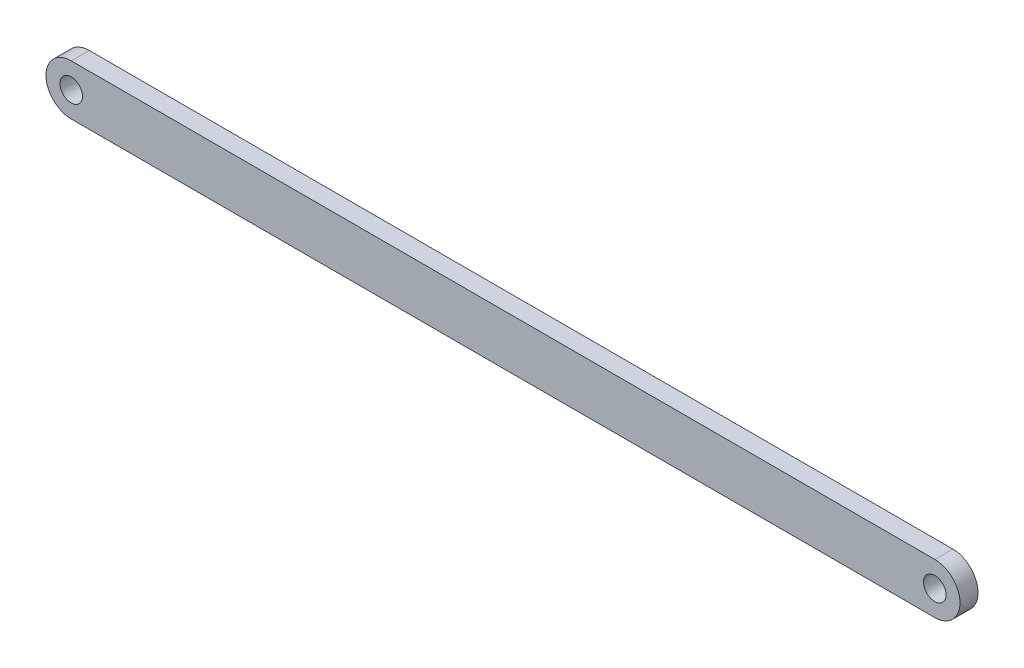
ISO-10303-21;
HEADER;
FILE_DESCRIPTION(('STEP AP214'),'2;1');
FILE_NAME('part.step','',(''),(''),'','','');
FILE_SCHEMA(('AUTOMOTIVE_DESIGN { 1 0 10303 214 1 1 1 1 }'));
ENDSEC;
DATA;
#1=APPLICATION_CONTEXT('core data for automotive mechanical design processes');
#2=APPLICATION_PROTOCOL_DEFINITION('international standard','automotive_design',2000,#1);
#3=PRODUCT_CONTEXT('',#1,'mechanical');
#4=PRODUCT('Part','Part','',(#3));
#5=PRODUCT_RELATED_PRODUCT_CATEGORY('part','',(#4));
#6=PRODUCT_DEFINITION_FORMATION('','',#4);
#7=PRODUCT_DEFINITION_CONTEXT('part definition',#1,'design');
#8=PRODUCT_DEFINITION('design','',#6,#7);
#9=PRODUCT_DEFINITION_SHAPE('','',#8);
#10=(LENGTH_UNIT() NAMED_UNIT(*) SI_UNIT(.MILLI.,.METRE.));
#11=(NAMED_UNIT(*) PLANE_ANGLE_UNIT() SI_UNIT($,.RADIAN.));
#12=(NAMED_UNIT(*) SI_UNIT($,.STERADIAN.) SOLID_ANGLE_UNIT());
#13=UNCERTAINTY_MEASURE_WITH_UNIT(LENGTH_MEASURE(1.E-05),#10,'distance_accuracy_value','');
#14=(GEOMETRIC_REPRESENTATION_CONTEXT(3) GLOBAL_UNCERTAINTY_ASSIGNED_CONTEXT((#13)) GLOBAL_UNIT_ASSIGNED_CONTEXT((#10,
#11,#12)) REPRESENTATION_CONTEXT('',''));
#15=CARTESIAN_POINT('',(0.,0.,0.));
#16=DIRECTION('',(0.,0.,1.));
#17=DIRECTION('',(1.,0.,0.));
#18=AXIS2_PLACEMENT_3D('',#15,#16,#17);
#19=CARTESIAN_POINT('',(-76.2,0.,3.175));
#20=DIRECTION('',(0.,0.,-1.));
#21=DIRECTION('',(-1.,0.,0.));
#22=AXIS2_PLACEMENT_3D('',#19,#20,#21);
#23=CYLINDRICAL_SURFACE('',#22,4.445);
#24=CARTESIAN_POINT('',(-76.2,0.,0.));
#25=DIRECTION('',(0.,0.,1.));
#26=DIRECTION('',(1.,0.,0.));
#27=AXIS2_PLACEMENT_3D('',#24,#25,#26);
#28=CIRCLE('',#27,4.445);
#29=CARTESIAN_POINT('',(-76.2,4.445,0.));
#30=VERTEX_POINT('',#29);
#31=CARTESIAN_POINT('',(-76.2,-4.445,0.));
#32=VERTEX_POINT('',#31);
#33=EDGE_CURVE('E123',#30,#32,#28,.T.);
#34=ORIENTED_EDGE('',*,*,#33,.T.);
#35=DIRECTION('',(0.,0.,-1.));
#36=VECTOR('',#35,1.);
#37=CARTESIAN_POINT('',(-76.2,-4.445,3.175));
#38=LINE('',#37,#36);
#39=CARTESIAN_POINT('',(-76.2,-4.445,3.175));
#40=VERTEX_POINT('',#39);
#41=EDGE_CURVE('E11',#40,#32,#38,.T.);
#42=ORIENTED_EDGE('',*,*,#41,.F.);
#43=CARTESIAN_POINT('',(-76.2,0.,3.175));
#44=DIRECTION('',(0.,0.,1.));
#45=DIRECTION('',(1.,0.,0.));
#46=AXIS2_PLACEMENT_3D('',#43,#44,#45);
#47=CIRCLE('',#46,4.445);
#48=CARTESIAN_POINT('',(-76.2,4.445,3.175));
#49=VERTEX_POINT('',#48);
#50=EDGE_CURVE('E97',#49,#40,#47,.T.);
#51=ORIENTED_EDGE('',*,*,#50,.F.);
#52=DIRECTION('',(0.,0.,-1.));
#53=VECTOR('',#52,1.);
#54=CARTESIAN_POINT('',(-76.2,4.445,3.175));
#55=LINE('',#54,#53);
#56=EDGE_CURVE('E63',#49,#30,#55,.T.);
#57=ORIENTED_EDGE('',*,*,#56,.T.);
#58=EDGE_LOOP('',(#34,#42,#51,#57));
#59=FACE_BOUND('',#58,.T.);
#60=ADVANCED_FACE('F45',(#59),#23,.T.);
#61=CARTESIAN_POINT('',(0.,-4.445,3.175));
#62=DIRECTION('',(0.,1.,0.));
#63=DIRECTION('',(0.,0.,1.));
#64=AXIS2_PLACEMENT_3D('',#61,#62,#63);
#65=PLANE('',#64);
#66=DIRECTION('',(1.,0.,0.));
#67=VECTOR('',#66,1.);
#68=CARTESIAN_POINT('',(0.,-4.445,0.));
#69=LINE('',#68,#67);
#70=CARTESIAN_POINT('',(76.2,-4.445,0.));
#71=VERTEX_POINT('',#70);
#72=EDGE_CURVE('E103',#32,#71,#69,.T.);
#73=ORIENTED_EDGE('',*,*,#72,.T.);
#74=DIRECTION('',(0.,0.,-1.));
#75=VECTOR('',#74,1.);
#76=CARTESIAN_POINT('',(76.2,-4.445,3.175));
#77=LINE('',#76,#75);
#78=CARTESIAN_POINT('',(76.2,-4.445,3.175));
#79=VERTEX_POINT('',#78);
#80=EDGE_CURVE('E55',#79,#71,#77,.T.);
#81=ORIENTED_EDGE('',*,*,#80,.F.);
#82=DIRECTION('',(1.,0.,0.));
#83=VECTOR('',#82,1.);
#84=CARTESIAN_POINT('',(0.,-4.445,3.175));
#85=LINE('',#84,#83);
#86=EDGE_CURVE('E89',#40,#79,#85,.T.);
#87=ORIENTED_EDGE('',*,*,#86,.F.);
#88=ORIENTED_EDGE('',*,*,#41,.T.);
#89=EDGE_LOOP('',(#73,#81,#87,#88));
#90=FACE_BOUND('',#89,.T.);
#91=ADVANCED_FACE('F102',(#90),#65,.F.);
#92=CARTESIAN_POINT('',(76.2,0.,3.175));
#93=DIRECTION('',(0.,0.,-1.));
#94=DIRECTION('',(-1.,0.,0.));
#95=AXIS2_PLACEMENT_3D('',#92,#93,#94);
#96=CYLINDRICAL_SURFACE('',#95,4.445);
#97=CARTESIAN_POINT('',(76.2,0.,0.));
#98=DIRECTION('',(0.,0.,1.));
#99=DIRECTION('',(1.,0.,0.));
#100=AXIS2_PLACEMENT_3D('',#97,#98,#99);
#101=CIRCLE('',#100,4.445);
#102=CARTESIAN_POINT('',(76.2,4.445,0.));
#103=VERTEX_POINT('',#102);
#104=EDGE_CURVE('E128',#71,#103,#101,.T.);
#105=ORIENTED_EDGE('',*,*,#104,.T.);
#106=DIRECTION('',(0.,0.,-1.));
#107=VECTOR('',#106,1.);
#108=CARTESIAN_POINT('',(76.2,4.445,3.175));
#109=LINE('',#108,#107);
#110=CARTESIAN_POINT('',(76.2,4.445,3.175));
#111=VERTEX_POINT('',#110);
#112=EDGE_CURVE('E78',#111,#103,#109,.T.);
#113=ORIENTED_EDGE('',*,*,#112,.F.);
#114=CARTESIAN_POINT('',(76.2,0.,3.175));
#115=DIRECTION('',(0.,0.,1.));
#116=DIRECTION('',(1.,0.,0.));
#117=AXIS2_PLACEMENT_3D('',#114,#115,#116);
#118=CIRCLE('',#117,4.445);
#119=EDGE_CURVE('E96',#79,#111,#118,.T.);
#120=ORIENTED_EDGE('',*,*,#119,.F.);
#121=ORIENTED_EDGE('',*,*,#80,.T.);
#122=EDGE_LOOP('',(#105,#113,#120,#121));
#123=FACE_BOUND('',#122,.T.);
#124=ADVANCED_FACE('F107',(#123),#96,.T.);
#125=CARTESIAN_POINT('',(0.,4.445,3.175));
#126=DIRECTION('',(0.,1.,0.));
#127=DIRECTION('',(0.,0.,1.));
#128=AXIS2_PLACEMENT_3D('',#125,#126,#127);
#129=PLANE('',#128);
#130=DIRECTION('',(1.,0.,0.));
#131=VECTOR('',#130,1.);
#132=CARTESIAN_POINT('',(0.,4.445,0.));
#133=LINE('',#132,#131);
#134=EDGE_CURVE('E131',#30,#103,#133,.T.);
#135=ORIENTED_EDGE('',*,*,#134,.F.);
#136=ORIENTED_EDGE('',*,*,#56,.F.);
#137=DIRECTION('',(1.,0.,0.));
#138=VECTOR('',#137,1.);
#139=CARTESIAN_POINT('',(0.,4.445,3.175));
#140=LINE('',#139,#138);
#141=EDGE_CURVE('E109',#49,#111,#140,.T.);
#142=ORIENTED_EDGE('',*,*,#141,.T.);
#143=ORIENTED_EDGE('',*,*,#112,.T.);
#144=EDGE_LOOP('',(#135,#136,#142,#143));
#145=FACE_BOUND('',#144,.T.);
#146=ADVANCED_FACE('F173',(#145),#129,.T.);
#147=CARTESIAN_POINT('',(76.2,0.,3.175));
#148=DIRECTION('',(0.,0.,-1.));
#149=DIRECTION('',(-1.,0.,0.));
#150=AXIS2_PLACEMENT_3D('',#147,#148,#149);
#151=CYLINDRICAL_SURFACE('',#150,1.99389999999999);
#152=CARTESIAN_POINT('',(76.2,0.,3.175));
#153=DIRECTION('',(0.,0.,1.));
#154=DIRECTION('',(1.,0.,0.));
#155=AXIS2_PLACEMENT_3D('',#152,#153,#154);
#156=CIRCLE('',#155,1.99389999999999);
#157=CARTESIAN_POINT('',(78.1939,0.,3.175));
#158=VERTEX_POINT('',#157);
#159=EDGE_CURVE('E139',#158,#158,#156,.T.);
#160=ORIENTED_EDGE('',*,*,#159,.T.);
#161=EDGE_LOOP('',(#160));
#162=FACE_BOUND('',#161,.T.);
#163=CARTESIAN_POINT('',(76.2,0.,0.));
#164=DIRECTION('',(0.,0.,1.));
#165=DIRECTION('',(1.,0.,0.));
#166=AXIS2_PLACEMENT_3D('',#163,#164,#165);
#167=CIRCLE('',#166,1.99389999999999);
#168=CARTESIAN_POINT('',(78.1939,0.,0.));
#169=VERTEX_POINT('',#168);
#170=EDGE_CURVE('E119',#169,#169,#167,.T.);
#171=ORIENTED_EDGE('',*,*,#170,.F.);
#172=EDGE_LOOP('',(#171));
#173=FACE_BOUND('',#172,.T.);
#174=ADVANCED_FACE('F47',(#162,#173),#151,.F.);
#175=CARTESIAN_POINT('',(-76.2,0.,3.175));
#176=DIRECTION('',(0.,0.,-1.));
#177=DIRECTION('',(-1.,0.,0.));
#178=AXIS2_PLACEMENT_3D('',#175,#176,#177);
#179=CYLINDRICAL_SURFACE('',#178,1.99389999999999);
#180=CARTESIAN_POINT('',(-76.2,0.,3.175));
#181=DIRECTION('',(0.,0.,1.));
#182=DIRECTION('',(1.,0.,0.));
#183=AXIS2_PLACEMENT_3D('',#180,#181,#182);
#184=CIRCLE('',#183,1.99389999999999);
#185=CARTESIAN_POINT('',(-74.2061,0.,3.175));
#186=VERTEX_POINT('',#185);
#187=EDGE_CURVE('E112',#186,#186,#184,.T.);
#188=ORIENTED_EDGE('',*,*,#187,.T.);
#189=EDGE_LOOP('',(#188));
#190=FACE_BOUND('',#189,.T.);
#191=CARTESIAN_POINT('',(-76.2,0.,0.));
#192=DIRECTION('',(0.,0.,1.));
#193=DIRECTION('',(1.,0.,0.));
#194=AXIS2_PLACEMENT_3D('',#191,#192,#193);
#195=CIRCLE('',#194,1.99389999999999);
#196=CARTESIAN_POINT('',(-74.2061,0.,0.));
#197=VERTEX_POINT('',#196);
#198=EDGE_CURVE('E135',#197,#197,#195,.T.);
#199=ORIENTED_EDGE('',*,*,#198,.F.);
#200=EDGE_LOOP('',(#199));
#201=FACE_BOUND('',#200,.T.);
#202=ADVANCED_FACE('F155',(#190,#201),#179,.F.);
#203=CARTESIAN_POINT('',(0.,0.,3.175));
#204=DIRECTION('',(0.,0.,1.));
#205=DIRECTION('',(1.,0.,0.));
#206=AXIS2_PLACEMENT_3D('',#203,#204,#205);
#207=PLANE('',#206);
#208=ORIENTED_EDGE('',*,*,#159,.F.);
#209=EDGE_LOOP('',(#208));
#210=FACE_BOUND('',#209,.T.);
#211=ORIENTED_EDGE('',*,*,#50,.T.);
#212=ORIENTED_EDGE('',*,*,#86,.T.);
#213=ORIENTED_EDGE('',*,*,#119,.T.);
#214=ORIENTED_EDGE('',*,*,#141,.F.);
#215=EDGE_LOOP('',(#211,#212,#213,#214));
#216=FACE_BOUND('',#215,.T.);
#217=ORIENTED_EDGE('',*,*,#187,.F.);
#218=EDGE_LOOP('',(#217));
#219=FACE_BOUND('',#218,.T.);
#220=ADVANCED_FACE('F92',(#210,#216,#219),#207,.T.);
#221=CARTESIAN_POINT('',(0.,0.,0.));
#222=DIRECTION('',(0.,0.,1.));
#223=DIRECTION('',(1.,0.,0.));
#224=AXIS2_PLACEMENT_3D('',#221,#222,#223);
#225=PLANE('',#224);
#226=ORIENTED_EDGE('',*,*,#170,.T.);
#227=EDGE_LOOP('',(#226));
#228=FACE_BOUND('',#227,.T.);
#229=ORIENTED_EDGE('',*,*,#33,.F.);
#230=ORIENTED_EDGE('',*,*,#134,.T.);
#231=ORIENTED_EDGE('',*,*,#104,.F.);
#232=ORIENTED_EDGE('',*,*,#72,.F.);
#233=EDGE_LOOP('',(#229,#230,#231,#232));
#234=FACE_BOUND('',#233,.T.);
#235=ORIENTED_EDGE('',*,*,#198,.T.);
#236=EDGE_LOOP('',(#235));
#237=FACE_BOUND('',#236,.T.);
#238=ADVANCED_FACE('F154',(#228,#234,#237),#225,.F.);
#239=CLOSED_SHELL('',(#60,#91,#124,#146,#174,#202,#220,#238));
#240=MANIFOLD_SOLID_BREP('B2',#239);
#241=ADVANCED_BREP_SHAPE_REPRESENTATION('',(#18,#240),#14);
#242=SHAPE_DEFINITION_REPRESENTATION(#9,#241);
ENDSEC;
END-ISO-10303-21;
